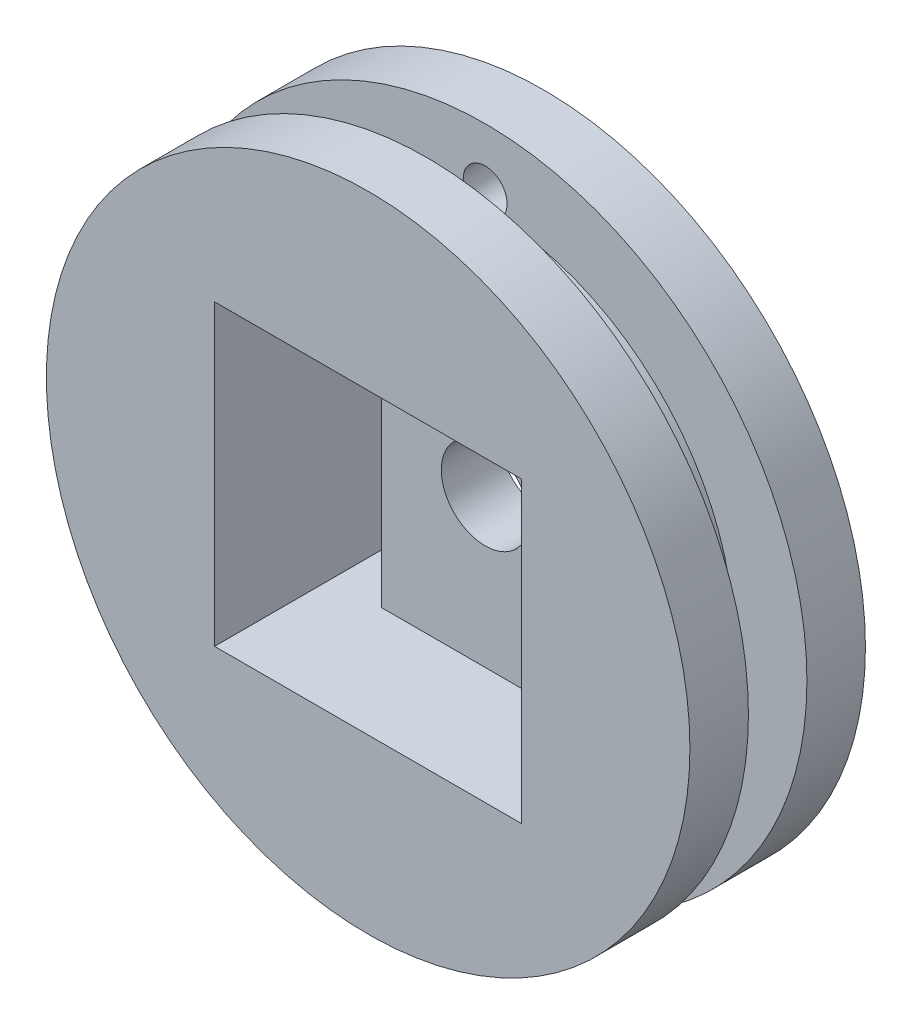
ISO-10303-21;
HEADER;
FILE_DESCRIPTION(('STEP AP214'),'2;1');
FILE_NAME('part.step','',(''),(''),'','','');
FILE_SCHEMA(('AUTOMOTIVE_DESIGN { 1 0 10303 214 1 1 1 1 }'));
ENDSEC;
DATA;
#1=APPLICATION_CONTEXT('core data for automotive mechanical design processes');
#2=APPLICATION_PROTOCOL_DEFINITION('international standard','automotive_design',2000,#1);
#3=PRODUCT_CONTEXT('',#1,'mechanical');
#4=PRODUCT('Part','Part','',(#3));
#5=PRODUCT_RELATED_PRODUCT_CATEGORY('part','',(#4));
#6=PRODUCT_DEFINITION_FORMATION('','',#4);
#7=PRODUCT_DEFINITION_CONTEXT('part definition',#1,'design');
#8=PRODUCT_DEFINITION('design','',#6,#7);
#9=PRODUCT_DEFINITION_SHAPE('','',#8);
#10=(LENGTH_UNIT() NAMED_UNIT(*) SI_UNIT(.MILLI.,.METRE.));
#11=(NAMED_UNIT(*) PLANE_ANGLE_UNIT() SI_UNIT($,.RADIAN.));
#12=(NAMED_UNIT(*) SI_UNIT($,.STERADIAN.) SOLID_ANGLE_UNIT());
#13=UNCERTAINTY_MEASURE_WITH_UNIT(LENGTH_MEASURE(1.E-05),#10,'distance_accuracy_value','');
#14=(GEOMETRIC_REPRESENTATION_CONTEXT(3) GLOBAL_UNCERTAINTY_ASSIGNED_CONTEXT((#13)) GLOBAL_UNIT_ASSIGNED_CONTEXT((#10,
#11,#12)) REPRESENTATION_CONTEXT('',''));
#15=CARTESIAN_POINT('',(0.,0.,0.));
#16=DIRECTION('',(0.,0.,1.));
#17=DIRECTION('',(1.,0.,0.));
#18=AXIS2_PLACEMENT_3D('',#15,#16,#17);
#19=CARTESIAN_POINT('',(0.,0.,2.));
#20=DIRECTION('',(0.,0.,1.));
#21=DIRECTION('',(1.,0.,0.));
#22=AXIS2_PLACEMENT_3D('',#19,#20,#21);
#23=PLANE('',#22);
#24=CARTESIAN_POINT('',(0.,0.,2.));
#25=DIRECTION('',(0.,0.,1.));
#26=DIRECTION('',(1.,0.,0.));
#27=AXIS2_PLACEMENT_3D('',#24,#25,#26);
#28=CIRCLE('',#27,1.5);
#29=CARTESIAN_POINT('',(1.5,0.,2.));
#30=VERTEX_POINT('',#29);
#31=EDGE_CURVE('E182',#30,#30,#28,.T.);
#32=ORIENTED_EDGE('',*,*,#31,.F.);
#33=EDGE_LOOP('',(#32));
#34=FACE_BOUND('',#33,.T.);
#35=DIRECTION('',(0.,1.,0.));
#36=VECTOR('',#35,1.);
#37=CARTESIAN_POINT('',(-3.55,5.1,2.));
#38=LINE('',#37,#36);
#39=CARTESIAN_POINT('',(-3.55,-5.1,2.));
#40=VERTEX_POINT('',#39);
#41=CARTESIAN_POINT('',(-3.55,5.1,2.));
#42=VERTEX_POINT('',#41);
#43=EDGE_CURVE('E173',#40,#42,#38,.T.);
#44=ORIENTED_EDGE('',*,*,#43,.F.);
#45=DIRECTION('',(1.,0.,0.));
#46=VECTOR('',#45,1.);
#47=CARTESIAN_POINT('',(-5.25,-5.1,2.));
#48=LINE('',#47,#46);
#49=CARTESIAN_POINT('',(3.55,-5.1,2.));
#50=VERTEX_POINT('',#49);
#51=EDGE_CURVE('E42',#40,#50,#48,.T.);
#52=ORIENTED_EDGE('',*,*,#51,.T.);
#53=DIRECTION('',(0.,-1.,0.));
#54=VECTOR('',#53,1.);
#55=CARTESIAN_POINT('',(3.55,5.1,2.));
#56=LINE('',#55,#54);
#57=CARTESIAN_POINT('',(3.55,5.1,2.));
#58=VERTEX_POINT('',#57);
#59=EDGE_CURVE('E157',#58,#50,#56,.T.);
#60=ORIENTED_EDGE('',*,*,#59,.F.);
#61=DIRECTION('',(-1.,0.,0.));
#62=VECTOR('',#61,1.);
#63=CARTESIAN_POINT('',(-5.25,5.1,2.));
#64=LINE('',#63,#62);
#65=EDGE_CURVE('E191',#58,#42,#64,.T.);
#66=ORIENTED_EDGE('',*,*,#65,.T.);
#67=EDGE_LOOP('',(#44,#52,#60,#66));
#68=FACE_BOUND('',#67,.T.);
#69=ADVANCED_FACE('F33',(#34,#68),#23,.T.);
#70=CARTESIAN_POINT('',(0.,0.,2.));
#71=DIRECTION('',(0.,0.,1.));
#72=DIRECTION('',(1.,0.,0.));
#73=AXIS2_PLACEMENT_3D('',#70,#71,#72);
#74=CIRCLE('',#73,8.5);
#75=CARTESIAN_POINT('',(-0.542989392815254,8.48263888888889,2.));
#76=VERTEX_POINT('',#75);
#77=CARTESIAN_POINT('',(0.542989392815254,8.48263888888889,2.));
#78=VERTEX_POINT('',#77);
#79=EDGE_CURVE('E11',#76,#78,#74,.T.);
#80=ORIENTED_EDGE('',*,*,#79,.F.);
#81=CARTESIAN_POINT('',(0.,9.,2.));
#82=DIRECTION('',(0.,0.,1.));
#83=DIRECTION('',(1.,0.,0.));
#84=AXIS2_PLACEMENT_3D('',#81,#82,#83);
#85=CIRCLE('',#84,0.75);
#86=EDGE_CURVE('E179',#78,#76,#85,.T.);
#87=ORIENTED_EDGE('',*,*,#86,.F.);
#88=EDGE_LOOP('',(#80,#87));
#89=FACE_BOUND('',#88,.T.);
#90=CARTESIAN_POINT('',(0.,0.,2.));
#91=DIRECTION('',(0.,0.,1.));
#92=DIRECTION('',(1.,0.,0.));
#93=AXIS2_PLACEMENT_3D('',#90,#91,#92);
#94=CIRCLE('',#93,10.9999999999456);
#95=CARTESIAN_POINT('',(10.9999999999456,0.,2.));
#96=VERTEX_POINT('',#95);
#97=EDGE_CURVE('E188',#96,#96,#94,.T.);
#98=ORIENTED_EDGE('',*,*,#97,.T.);
#99=EDGE_LOOP('',(#98));
#100=FACE_BOUND('',#99,.T.);
#101=ADVANCED_FACE('F251',(#89,#100),#23,.T.);
#102=CARTESIAN_POINT('',(0.,0.,0.));
#103=DIRECTION('',(0.,0.,1.));
#104=DIRECTION('',(1.,0.,0.));
#105=AXIS2_PLACEMENT_3D('',#102,#103,#104);
#106=PLANE('',#105);
#107=DIRECTION('',(0.,-1.,0.));
#108=VECTOR('',#107,1.);
#109=CARTESIAN_POINT('',(-5.25,5.1,0.));
#110=LINE('',#109,#108);
#111=CARTESIAN_POINT('',(-5.25,5.1,0.));
#112=VERTEX_POINT('',#111);
#113=CARTESIAN_POINT('',(-5.25,-5.1,0.));
#114=VERTEX_POINT('',#113);
#115=EDGE_CURVE('E163',#112,#114,#110,.T.);
#116=ORIENTED_EDGE('',*,*,#115,.T.);
#117=DIRECTION('',(1.,0.,0.));
#118=VECTOR('',#117,1.);
#119=CARTESIAN_POINT('',(-5.25,-5.1,0.));
#120=LINE('',#119,#118);
#121=CARTESIAN_POINT('',(-3.55,-5.1,0.));
#122=VERTEX_POINT('',#121);
#123=EDGE_CURVE('E114',#114,#122,#120,.T.);
#124=ORIENTED_EDGE('',*,*,#123,.T.);
#125=DIRECTION('',(0.,1.,0.));
#126=VECTOR('',#125,1.);
#127=CARTESIAN_POINT('',(-3.55,5.1,0.));
#128=LINE('',#127,#126);
#129=CARTESIAN_POINT('',(-3.55,5.1,0.));
#130=VERTEX_POINT('',#129);
#131=EDGE_CURVE('E167',#122,#130,#128,.T.);
#132=ORIENTED_EDGE('',*,*,#131,.T.);
#133=DIRECTION('',(-1.,0.,0.));
#134=VECTOR('',#133,1.);
#135=CARTESIAN_POINT('',(-5.25,5.1,0.));
#136=LINE('',#135,#134);
#137=EDGE_CURVE('E170',#130,#112,#136,.T.);
#138=ORIENTED_EDGE('',*,*,#137,.T.);
#139=EDGE_LOOP('',(#116,#124,#132,#138));
#140=FACE_BOUND('',#139,.T.);
#141=CARTESIAN_POINT('',(0.,0.,0.));
#142=DIRECTION('',(0.,0.,1.));
#143=DIRECTION('',(1.,0.,0.));
#144=AXIS2_PLACEMENT_3D('',#141,#142,#143);
#145=CIRCLE('',#144,1.5);
#146=CARTESIAN_POINT('',(1.5,0.,0.));
#147=VERTEX_POINT('',#146);
#148=EDGE_CURVE('E178',#147,#147,#145,.T.);
#149=ORIENTED_EDGE('',*,*,#148,.T.);
#150=EDGE_LOOP('',(#149));
#151=FACE_BOUND('',#150,.T.);
#152=CARTESIAN_POINT('',(0.,0.,0.));
#153=DIRECTION('',(0.,0.,1.));
#154=DIRECTION('',(1.,0.,0.));
#155=AXIS2_PLACEMENT_3D('',#152,#153,#154);
#156=CIRCLE('',#155,10.9999999999456);
#157=CARTESIAN_POINT('',(10.9999999999456,0.,0.));
#158=VERTEX_POINT('',#157);
#159=EDGE_CURVE('E185',#158,#158,#156,.T.);
#160=ORIENTED_EDGE('',*,*,#159,.F.);
#161=EDGE_LOOP('',(#160));
#162=FACE_BOUND('',#161,.T.);
#163=CARTESIAN_POINT('',(0.,9.,0.));
#164=DIRECTION('',(0.,0.,1.));
#165=DIRECTION('',(1.,0.,0.));
#166=AXIS2_PLACEMENT_3D('',#163,#164,#165);
#167=CIRCLE('',#166,0.75);
#168=CARTESIAN_POINT('',(0.75,9.,0.));
#169=VERTEX_POINT('',#168);
#170=EDGE_CURVE('E117',#169,#169,#167,.T.);
#171=ORIENTED_EDGE('',*,*,#170,.T.);
#172=EDGE_LOOP('',(#171));
#173=FACE_BOUND('',#172,.T.);
#174=DIRECTION('',(-1.,0.,0.));
#175=VECTOR('',#174,1.);
#176=CARTESIAN_POINT('',(5.25,5.1,0.));
#177=LINE('',#176,#175);
#178=CARTESIAN_POINT('',(5.25,5.1,0.));
#179=VERTEX_POINT('',#178);
#180=CARTESIAN_POINT('',(3.55,5.1,0.));
#181=VERTEX_POINT('',#180);
#182=EDGE_CURVE('E56',#179,#181,#177,.T.);
#183=ORIENTED_EDGE('',*,*,#182,.T.);
#184=DIRECTION('',(0.,-1.,0.));
#185=VECTOR('',#184,1.);
#186=CARTESIAN_POINT('',(3.55,5.1,0.));
#187=LINE('',#186,#185);
#188=CARTESIAN_POINT('',(3.55,-5.1,0.));
#189=VERTEX_POINT('',#188);
#190=EDGE_CURVE('E148',#181,#189,#187,.T.);
#191=ORIENTED_EDGE('',*,*,#190,.T.);
#192=DIRECTION('',(1.,0.,0.));
#193=VECTOR('',#192,1.);
#194=CARTESIAN_POINT('',(5.25,-5.1,0.));
#195=LINE('',#194,#193);
#196=CARTESIAN_POINT('',(5.25,-5.1,0.));
#197=VERTEX_POINT('',#196);
#198=EDGE_CURVE('E151',#189,#197,#195,.T.);
#199=ORIENTED_EDGE('',*,*,#198,.T.);
#200=DIRECTION('',(0.,1.,0.));
#201=VECTOR('',#200,1.);
#202=CARTESIAN_POINT('',(5.25,5.1,0.));
#203=LINE('',#202,#201);
#204=EDGE_CURVE('E154',#197,#179,#203,.T.);
#205=ORIENTED_EDGE('',*,*,#204,.T.);
#206=EDGE_LOOP('',(#183,#191,#199,#205));
#207=FACE_BOUND('',#206,.T.);
#208=ADVANCED_FACE('F230',(#140,#151,#162,#173,#207),#106,.F.);
#209=CARTESIAN_POINT('',(0.,0.,2.));
#210=DIRECTION('',(0.,0.,-1.));
#211=DIRECTION('',(-1.,0.,0.));
#212=AXIS2_PLACEMENT_3D('',#209,#210,#211);
#213=CYLINDRICAL_SURFACE('',#212,10.9999999999456);
#214=ORIENTED_EDGE('',*,*,#97,.F.);
#215=EDGE_LOOP('',(#214));
#216=FACE_BOUND('',#215,.T.);
#217=ORIENTED_EDGE('',*,*,#159,.T.);
#218=EDGE_LOOP('',(#217));
#219=FACE_BOUND('',#218,.T.);
#220=ADVANCED_FACE('F35',(#216,#219),#213,.T.);
#221=CARTESIAN_POINT('',(0.,0.,2.));
#222=DIRECTION('',(0.,0.,-1.));
#223=DIRECTION('',(-1.,0.,0.));
#224=AXIS2_PLACEMENT_3D('',#221,#222,#223);
#225=CYLINDRICAL_SURFACE('',#224,1.5);
#226=ORIENTED_EDGE('',*,*,#31,.T.);
#227=EDGE_LOOP('',(#226));
#228=FACE_BOUND('',#227,.T.);
#229=ORIENTED_EDGE('',*,*,#148,.F.);
#230=EDGE_LOOP('',(#229));
#231=FACE_BOUND('',#230,.T.);
#232=ADVANCED_FACE('F259',(#228,#231),#225,.F.);
#233=CARTESIAN_POINT('',(0.,9.,2.));
#234=DIRECTION('',(0.,0.,-1.));
#235=DIRECTION('',(-1.,0.,0.));
#236=AXIS2_PLACEMENT_3D('',#233,#234,#235);
#237=CYLINDRICAL_SURFACE('',#236,0.75);
#238=EDGE_CURVE('E176',#76,#78,#85,.T.);
#239=ORIENTED_EDGE('',*,*,#238,.T.);
#240=ORIENTED_EDGE('',*,*,#86,.T.);
#241=EDGE_LOOP('',(#239,#240));
#242=FACE_BOUND('',#241,.T.);
#243=ORIENTED_EDGE('',*,*,#170,.F.);
#244=EDGE_LOOP('',(#243));
#245=FACE_BOUND('',#244,.T.);
#246=ADVANCED_FACE('F269',(#242,#245),#237,.F.);
#247=CARTESIAN_POINT('',(-5.25,5.1,2.));
#248=DIRECTION('',(1.,0.,0.));
#249=DIRECTION('',(0.,0.,-1.));
#250=AXIS2_PLACEMENT_3D('',#247,#248,#249);
#251=PLANE('',#250);
#252=ORIENTED_EDGE('',*,*,#115,.F.);
#253=DIRECTION('',(0.,0.,-1.));
#254=VECTOR('',#253,1.);
#255=CARTESIAN_POINT('',(-5.25,5.1,2.));
#256=LINE('',#255,#254);
#257=CARTESIAN_POINT('',(-5.25,5.1,6.));
#258=VERTEX_POINT('',#257);
#259=EDGE_CURVE('E124',#258,#112,#256,.T.);
#260=ORIENTED_EDGE('',*,*,#259,.F.);
#261=DIRECTION('',(0.,-1.,0.));
#262=VECTOR('',#261,1.);
#263=CARTESIAN_POINT('',(-5.25,5.1,6.));
#264=LINE('',#263,#262);
#265=CARTESIAN_POINT('',(-5.25,-5.1,6.));
#266=VERTEX_POINT('',#265);
#267=EDGE_CURVE('E121',#258,#266,#264,.T.);
#268=ORIENTED_EDGE('',*,*,#267,.T.);
#269=DIRECTION('',(0.,0.,-1.));
#270=VECTOR('',#269,1.);
#271=CARTESIAN_POINT('',(-5.25,-5.1,2.));
#272=LINE('',#271,#270);
#273=EDGE_CURVE('E107',#266,#114,#272,.T.);
#274=ORIENTED_EDGE('',*,*,#273,.T.);
#275=EDGE_LOOP('',(#252,#260,#268,#274));
#276=FACE_BOUND('',#275,.T.);
#277=ADVANCED_FACE('F122',(#276),#251,.T.);
#278=CARTESIAN_POINT('',(-5.25,-5.1,2.));
#279=DIRECTION('',(0.,1.,0.));
#280=DIRECTION('',(-1.,0.,0.));
#281=AXIS2_PLACEMENT_3D('',#278,#279,#280);
#282=PLANE('',#281);
#283=ORIENTED_EDGE('',*,*,#123,.F.);
#284=ORIENTED_EDGE('',*,*,#273,.F.);
#285=DIRECTION('',(1.,0.,0.));
#286=VECTOR('',#285,1.);
#287=CARTESIAN_POINT('',(-5.25,-5.1,6.));
#288=LINE('',#287,#286);
#289=CARTESIAN_POINT('',(5.25,-5.1,6.));
#290=VERTEX_POINT('',#289);
#291=EDGE_CURVE('E111',#266,#290,#288,.T.);
#292=ORIENTED_EDGE('',*,*,#291,.T.);
#293=DIRECTION('',(0.,0.,-1.));
#294=VECTOR('',#293,1.);
#295=CARTESIAN_POINT('',(5.25,-5.1,2.));
#296=LINE('',#295,#294);
#297=EDGE_CURVE('E160',#290,#197,#296,.T.);
#298=ORIENTED_EDGE('',*,*,#297,.T.);
#299=ORIENTED_EDGE('',*,*,#198,.F.);
#300=DIRECTION('',(0.,0.,-1.));
#301=VECTOR('',#300,1.);
#302=CARTESIAN_POINT('',(3.55,-5.1,2.));
#303=LINE('',#302,#301);
#304=EDGE_CURVE('E162',#50,#189,#303,.T.);
#305=ORIENTED_EDGE('',*,*,#304,.F.);
#306=ORIENTED_EDGE('',*,*,#51,.F.);
#307=DIRECTION('',(0.,0.,-1.));
#308=VECTOR('',#307,1.);
#309=CARTESIAN_POINT('',(-3.55,-5.1,2.));
#310=LINE('',#309,#308);
#311=EDGE_CURVE('E118',#40,#122,#310,.T.);
#312=ORIENTED_EDGE('',*,*,#311,.T.);
#313=EDGE_LOOP('',(#283,#284,#292,#298,#299,#305,#306,#312));
#314=FACE_BOUND('',#313,.T.);
#315=ADVANCED_FACE('F109',(#314),#282,.T.);
#316=CARTESIAN_POINT('',(-3.55,5.1,2.));
#317=DIRECTION('',(-1.,0.,0.));
#318=DIRECTION('',(0.,0.,1.));
#319=AXIS2_PLACEMENT_3D('',#316,#317,#318);
#320=PLANE('',#319);
#321=ORIENTED_EDGE('',*,*,#131,.F.);
#322=ORIENTED_EDGE('',*,*,#311,.F.);
#323=ORIENTED_EDGE('',*,*,#43,.T.);
#324=DIRECTION('',(0.,0.,-1.));
#325=VECTOR('',#324,1.);
#326=CARTESIAN_POINT('',(-3.55,5.1,2.));
#327=LINE('',#326,#325);
#328=EDGE_CURVE('E174',#42,#130,#327,.T.);
#329=ORIENTED_EDGE('',*,*,#328,.T.);
#330=EDGE_LOOP('',(#321,#322,#323,#329));
#331=FACE_BOUND('',#330,.T.);
#332=ADVANCED_FACE('F233',(#331),#320,.T.);
#333=CARTESIAN_POINT('',(-5.25,5.1,2.));
#334=DIRECTION('',(0.,-1.,0.));
#335=DIRECTION('',(0.,0.,-1.));
#336=AXIS2_PLACEMENT_3D('',#333,#334,#335);
#337=PLANE('',#336);
#338=ORIENTED_EDGE('',*,*,#137,.F.);
#339=ORIENTED_EDGE('',*,*,#328,.F.);
#340=ORIENTED_EDGE('',*,*,#65,.F.);
#341=DIRECTION('',(0.,0.,-1.));
#342=VECTOR('',#341,1.);
#343=CARTESIAN_POINT('',(3.55,5.1,2.));
#344=LINE('',#343,#342);
#345=EDGE_CURVE('E165',#58,#181,#344,.T.);
#346=ORIENTED_EDGE('',*,*,#345,.T.);
#347=ORIENTED_EDGE('',*,*,#182,.F.);
#348=DIRECTION('',(0.,0.,-1.));
#349=VECTOR('',#348,1.);
#350=CARTESIAN_POINT('',(5.25,5.1,2.));
#351=LINE('',#350,#349);
#352=CARTESIAN_POINT('',(5.25,5.1,6.));
#353=VERTEX_POINT('',#352);
#354=EDGE_CURVE('E158',#353,#179,#351,.T.);
#355=ORIENTED_EDGE('',*,*,#354,.F.);
#356=DIRECTION('',(-1.,0.,0.));
#357=VECTOR('',#356,1.);
#358=CARTESIAN_POINT('',(-5.25,5.1,6.));
#359=LINE('',#358,#357);
#360=EDGE_CURVE('E133',#353,#258,#359,.T.);
#361=ORIENTED_EDGE('',*,*,#360,.T.);
#362=ORIENTED_EDGE('',*,*,#259,.T.);
#363=EDGE_LOOP('',(#338,#339,#340,#346,#347,#355,#361,#362));
#364=FACE_BOUND('',#363,.T.);
#365=ADVANCED_FACE('F231',(#364),#337,.T.);
#366=CARTESIAN_POINT('',(3.55,5.1,2.));
#367=DIRECTION('',(1.,0.,0.));
#368=DIRECTION('',(0.,1.,0.));
#369=AXIS2_PLACEMENT_3D('',#366,#367,#368);
#370=PLANE('',#369);
#371=ORIENTED_EDGE('',*,*,#190,.F.);
#372=ORIENTED_EDGE('',*,*,#345,.F.);
#373=ORIENTED_EDGE('',*,*,#59,.T.);
#374=ORIENTED_EDGE('',*,*,#304,.T.);
#375=EDGE_LOOP('',(#371,#372,#373,#374));
#376=FACE_BOUND('',#375,.T.);
#377=ADVANCED_FACE('F225',(#376),#370,.T.);
#378=CARTESIAN_POINT('',(5.25,5.1,2.));
#379=DIRECTION('',(-1.,0.,0.));
#380=DIRECTION('',(0.,0.,1.));
#381=AXIS2_PLACEMENT_3D('',#378,#379,#380);
#382=PLANE('',#381);
#383=ORIENTED_EDGE('',*,*,#204,.F.);
#384=ORIENTED_EDGE('',*,*,#297,.F.);
#385=DIRECTION('',(0.,1.,0.));
#386=VECTOR('',#385,1.);
#387=CARTESIAN_POINT('',(5.25,5.1,6.));
#388=LINE('',#387,#386);
#389=EDGE_CURVE('E131',#290,#353,#388,.T.);
#390=ORIENTED_EDGE('',*,*,#389,.T.);
#391=ORIENTED_EDGE('',*,*,#354,.T.);
#392=EDGE_LOOP('',(#383,#384,#390,#391));
#393=FACE_BOUND('',#392,.T.);
#394=ADVANCED_FACE('F237',(#393),#382,.T.);
#395=CARTESIAN_POINT('',(0.,0.,2.));
#396=DIRECTION('',(0.,0.,1.));
#397=DIRECTION('',(1.,0.,0.));
#398=AXIS2_PLACEMENT_3D('',#395,#396,#397);
#399=PLANE('',#398);
#400=ORIENTED_EDGE('',*,*,#238,.F.);
#401=EDGE_CURVE('E44',#78,#76,#74,.T.);
#402=ORIENTED_EDGE('',*,*,#401,.F.);
#403=EDGE_LOOP('',(#400,#402));
#404=FACE_BOUND('',#403,.T.);
#405=ADVANCED_FACE('F239',(#404),#399,.F.);
#406=CARTESIAN_POINT('',(0.,0.,4.));
#407=DIRECTION('',(0.,0.,-1.));
#408=DIRECTION('',(-1.,0.,0.));
#409=AXIS2_PLACEMENT_3D('',#406,#407,#408);
#410=CYLINDRICAL_SURFACE('',#409,8.5);
#411=CARTESIAN_POINT('',(0.,0.,4.));
#412=DIRECTION('',(0.,0.,1.));
#413=DIRECTION('',(1.,0.,0.));
#414=AXIS2_PLACEMENT_3D('',#411,#412,#413);
#415=CIRCLE('',#414,8.5);
#416=CARTESIAN_POINT('',(8.5,0.,4.));
#417=VERTEX_POINT('',#416);
#418=EDGE_CURVE('E143',#417,#417,#415,.T.);
#419=ORIENTED_EDGE('',*,*,#418,.F.);
#420=EDGE_LOOP('',(#419));
#421=FACE_BOUND('',#420,.T.);
#422=ORIENTED_EDGE('',*,*,#401,.T.);
#423=ORIENTED_EDGE('',*,*,#79,.T.);
#424=EDGE_LOOP('',(#422,#423));
#425=FACE_BOUND('',#424,.T.);
#426=ADVANCED_FACE('F245',(#421,#425),#410,.T.);
#427=CARTESIAN_POINT('',(0.,0.,4.));
#428=DIRECTION('',(0.,0.,1.));
#429=DIRECTION('',(1.,0.,0.));
#430=AXIS2_PLACEMENT_3D('',#427,#428,#429);
#431=PLANE('',#430);
#432=CARTESIAN_POINT('',(0.,0.,4.));
#433=DIRECTION('',(0.,0.,1.));
#434=DIRECTION('',(1.,0.,0.));
#435=AXIS2_PLACEMENT_3D('',#432,#433,#434);
#436=CIRCLE('',#435,10.9999999999456);
#437=CARTESIAN_POINT('',(10.9999999999456,0.,4.));
#438=VERTEX_POINT('',#437);
#439=EDGE_CURVE('E137',#438,#438,#436,.T.);
#440=ORIENTED_EDGE('',*,*,#439,.F.);
#441=EDGE_LOOP('',(#440));
#442=FACE_BOUND('',#441,.T.);
#443=ORIENTED_EDGE('',*,*,#418,.T.);
#444=EDGE_LOOP('',(#443));
#445=FACE_BOUND('',#444,.T.);
#446=ADVANCED_FACE('F319',(#442,#445),#431,.F.);
#447=CARTESIAN_POINT('',(0.,0.,6.));
#448=DIRECTION('',(0.,0.,1.));
#449=DIRECTION('',(1.,0.,0.));
#450=AXIS2_PLACEMENT_3D('',#447,#448,#449);
#451=PLANE('',#450);
#452=CARTESIAN_POINT('',(0.,0.,6.));
#453=DIRECTION('',(0.,0.,1.));
#454=DIRECTION('',(1.,0.,0.));
#455=AXIS2_PLACEMENT_3D('',#452,#453,#454);
#456=CIRCLE('',#455,10.9999999999456);
#457=CARTESIAN_POINT('',(10.9999999999456,0.,6.));
#458=VERTEX_POINT('',#457);
#459=EDGE_CURVE('E138',#458,#458,#456,.T.);
#460=ORIENTED_EDGE('',*,*,#459,.T.);
#461=EDGE_LOOP('',(#460));
#462=FACE_BOUND('',#461,.T.);
#463=ORIENTED_EDGE('',*,*,#291,.F.);
#464=ORIENTED_EDGE('',*,*,#267,.F.);
#465=ORIENTED_EDGE('',*,*,#360,.F.);
#466=ORIENTED_EDGE('',*,*,#389,.F.);
#467=EDGE_LOOP('',(#463,#464,#465,#466));
#468=FACE_BOUND('',#467,.T.);
#469=ADVANCED_FACE('F129',(#462,#468),#451,.T.);
#470=CARTESIAN_POINT('',(0.,0.,6.));
#471=DIRECTION('',(0.,0.,-1.));
#472=DIRECTION('',(-1.,0.,0.));
#473=AXIS2_PLACEMENT_3D('',#470,#471,#472);
#474=CYLINDRICAL_SURFACE('',#473,10.9999999999456);
#475=ORIENTED_EDGE('',*,*,#459,.F.);
#476=EDGE_LOOP('',(#475));
#477=FACE_BOUND('',#476,.T.);
#478=ORIENTED_EDGE('',*,*,#439,.T.);
#479=EDGE_LOOP('',(#478));
#480=FACE_BOUND('',#479,.T.);
#481=ADVANCED_FACE('F365',(#477,#480),#474,.T.);
#482=CLOSED_SHELL('',(#69,#101,#208,#220,#232,#246,#277,#315,#332,#365,#377,#394,#405,#426,#446,
#469,#481));
#483=MANIFOLD_SOLID_BREP('B2',#482);
#484=ADVANCED_BREP_SHAPE_REPRESENTATION('',(#18,#483),#14);
#485=SHAPE_DEFINITION_REPRESENTATION(#9,#484);
ENDSEC;
END-ISO-10303-21;
